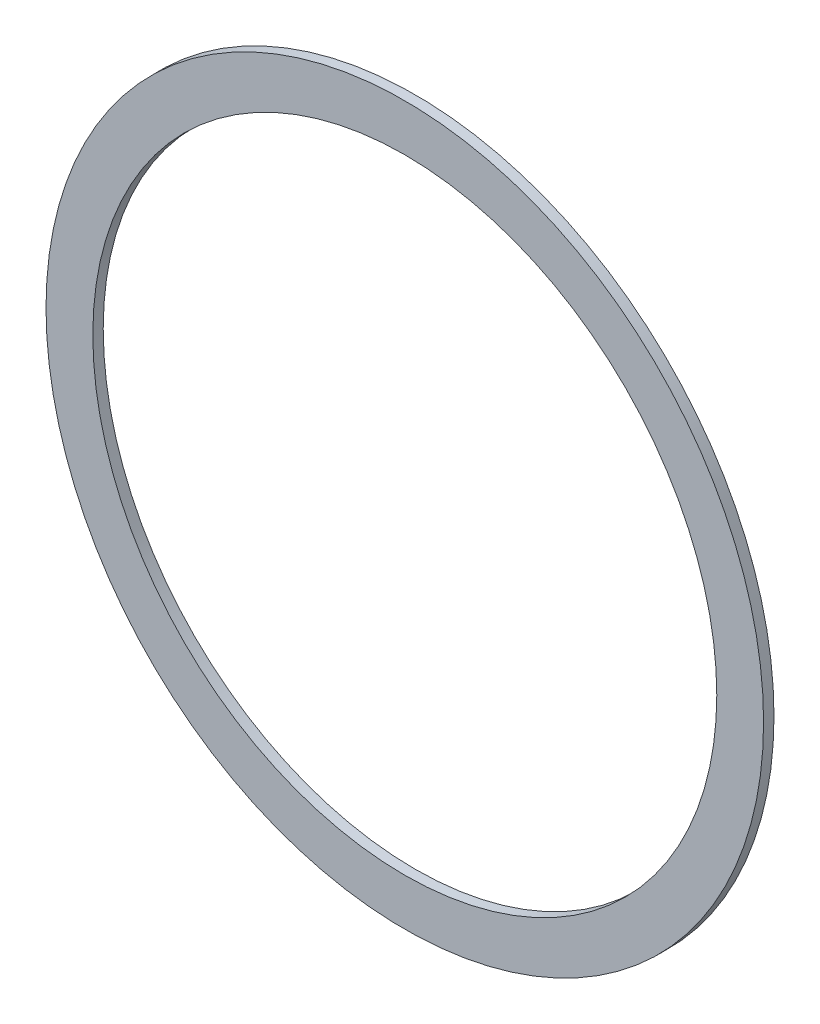
ISO-10303-21;
HEADER;
FILE_DESCRIPTION(('STEP AP214'),'2;1');
FILE_NAME('part.step','',(''),(''),'','','');
FILE_SCHEMA(('AUTOMOTIVE_DESIGN { 1 0 10303 214 1 1 1 1 }'));
ENDSEC;
DATA;
#1=APPLICATION_CONTEXT('core data for automotive mechanical design processes');
#2=APPLICATION_PROTOCOL_DEFINITION('international standard','automotive_design',2000,#1);
#3=PRODUCT_CONTEXT('',#1,'mechanical');
#4=PRODUCT('Part','Part','',(#3));
#5=PRODUCT_RELATED_PRODUCT_CATEGORY('part','',(#4));
#6=PRODUCT_DEFINITION_FORMATION('','',#4);
#7=PRODUCT_DEFINITION_CONTEXT('part definition',#1,'design');
#8=PRODUCT_DEFINITION('design','',#6,#7);
#9=PRODUCT_DEFINITION_SHAPE('','',#8);
#10=(LENGTH_UNIT() NAMED_UNIT(*) SI_UNIT(.MILLI.,.METRE.));
#11=(NAMED_UNIT(*) PLANE_ANGLE_UNIT() SI_UNIT($,.RADIAN.));
#12=(NAMED_UNIT(*) SI_UNIT($,.STERADIAN.) SOLID_ANGLE_UNIT());
#13=UNCERTAINTY_MEASURE_WITH_UNIT(LENGTH_MEASURE(1.E-05),#10,'distance_accuracy_value','');
#14=(GEOMETRIC_REPRESENTATION_CONTEXT(3) GLOBAL_UNCERTAINTY_ASSIGNED_CONTEXT((#13)) GLOBAL_UNIT_ASSIGNED_CONTEXT((#10,
#11,#12)) REPRESENTATION_CONTEXT('',''));
#15=CARTESIAN_POINT('',(0.,0.,0.));
#16=DIRECTION('',(0.,0.,1.));
#17=DIRECTION('',(1.,0.,0.));
#18=AXIS2_PLACEMENT_3D('',#15,#16,#17);
#19=CARTESIAN_POINT('',(0.,0.,1.));
#20=DIRECTION('',(0.,0.,1.));
#21=DIRECTION('',(1.,0.,0.));
#22=AXIS2_PLACEMENT_3D('',#19,#20,#21);
#23=PLANE('',#22);
#24=CARTESIAN_POINT('',(0.,0.,1.));
#25=DIRECTION('',(0.,0.,1.));
#26=DIRECTION('',(1.,0.,0.));
#27=AXIS2_PLACEMENT_3D('',#24,#25,#26);
#28=CIRCLE('',#27,69.);
#29=CARTESIAN_POINT('',(69.,0.,1.));
#30=VERTEX_POINT('',#29);
#31=EDGE_CURVE('E10',#30,#30,#28,.T.);
#32=ORIENTED_EDGE('',*,*,#31,.T.);
#33=EDGE_LOOP('',(#32));
#34=FACE_BOUND('',#33,.T.);
#35=CARTESIAN_POINT('',(0.,0.,1.));
#36=DIRECTION('',(0.,0.,1.));
#37=DIRECTION('',(1.,0.,0.));
#38=AXIS2_PLACEMENT_3D('',#35,#36,#37);
#39=CIRCLE('',#38,60.);
#40=CARTESIAN_POINT('',(60.,0.,1.));
#41=VERTEX_POINT('',#40);
#42=EDGE_CURVE('E41',#41,#41,#39,.T.);
#43=ORIENTED_EDGE('',*,*,#42,.F.);
#44=EDGE_LOOP('',(#43));
#45=FACE_BOUND('',#44,.T.);
#46=ADVANCED_FACE('F30',(#34,#45),#23,.T.);
#47=CARTESIAN_POINT('',(0.,0.,-1.));
#48=DIRECTION('',(0.,0.,1.));
#49=DIRECTION('',(1.,0.,0.));
#50=AXIS2_PLACEMENT_3D('',#47,#48,#49);
#51=PLANE('',#50);
#52=CARTESIAN_POINT('',(0.,0.,-1.));
#53=DIRECTION('',(0.,0.,1.));
#54=DIRECTION('',(1.,0.,0.));
#55=AXIS2_PLACEMENT_3D('',#52,#53,#54);
#56=CIRCLE('',#55,69.);
#57=CARTESIAN_POINT('',(69.,0.,-1.));
#58=VERTEX_POINT('',#57);
#59=EDGE_CURVE('E34',#58,#58,#56,.T.);
#60=ORIENTED_EDGE('',*,*,#59,.F.);
#61=EDGE_LOOP('',(#60));
#62=FACE_BOUND('',#61,.T.);
#63=CARTESIAN_POINT('',(0.,0.,-1.));
#64=DIRECTION('',(0.,0.,1.));
#65=DIRECTION('',(1.,0.,0.));
#66=AXIS2_PLACEMENT_3D('',#63,#64,#65);
#67=CIRCLE('',#66,60.);
#68=CARTESIAN_POINT('',(60.,0.,-1.));
#69=VERTEX_POINT('',#68);
#70=EDGE_CURVE('E43',#69,#69,#67,.T.);
#71=ORIENTED_EDGE('',*,*,#70,.T.);
#72=EDGE_LOOP('',(#71));
#73=FACE_BOUND('',#72,.T.);
#74=ADVANCED_FACE('F53',(#62,#73),#51,.F.);
#75=CARTESIAN_POINT('',(0.,0.,1.));
#76=DIRECTION('',(0.,0.,-1.));
#77=DIRECTION('',(-1.,0.,0.));
#78=AXIS2_PLACEMENT_3D('',#75,#76,#77);
#79=CYLINDRICAL_SURFACE('',#78,69.);
#80=ORIENTED_EDGE('',*,*,#31,.F.);
#81=EDGE_LOOP('',(#80));
#82=FACE_BOUND('',#81,.T.);
#83=ORIENTED_EDGE('',*,*,#59,.T.);
#84=EDGE_LOOP('',(#83));
#85=FACE_BOUND('',#84,.T.);
#86=ADVANCED_FACE('F32',(#82,#85),#79,.T.);
#87=CARTESIAN_POINT('',(0.,0.,1.));
#88=DIRECTION('',(0.,0.,-1.));
#89=DIRECTION('',(-1.,0.,0.));
#90=AXIS2_PLACEMENT_3D('',#87,#88,#89);
#91=CYLINDRICAL_SURFACE('',#90,60.);
#92=ORIENTED_EDGE('',*,*,#42,.T.);
#93=EDGE_LOOP('',(#92));
#94=FACE_BOUND('',#93,.T.);
#95=ORIENTED_EDGE('',*,*,#70,.F.);
#96=EDGE_LOOP('',(#95));
#97=FACE_BOUND('',#96,.T.);
#98=ADVANCED_FACE('F49',(#94,#97),#91,.F.);
#99=CLOSED_SHELL('',(#46,#74,#86,#98));
#100=MANIFOLD_SOLID_BREP('B2',#99);
#101=ADVANCED_BREP_SHAPE_REPRESENTATION('',(#18,#100),#14);
#102=SHAPE_DEFINITION_REPRESENTATION(#9,#101);
ENDSEC;
END-ISO-10303-21;
